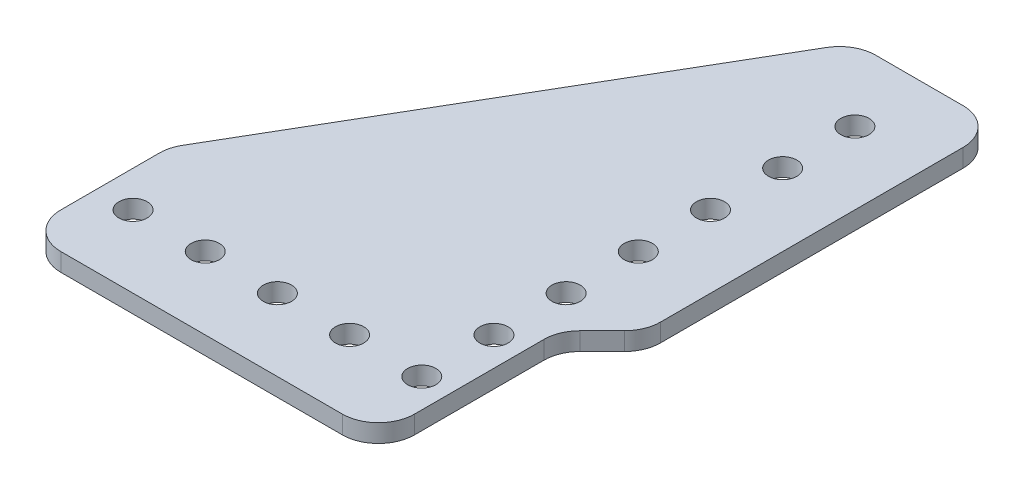
ISO-10303-21;
HEADER;
FILE_DESCRIPTION(('STEP AP214'),'2;1');
FILE_NAME('part.step','',(''),(''),'','','');
FILE_SCHEMA(('AUTOMOTIVE_DESIGN { 1 0 10303 214 1 1 1 1 }'));
ENDSEC;
DATA;
#1=APPLICATION_CONTEXT('core data for automotive mechanical design processes');
#2=APPLICATION_PROTOCOL_DEFINITION('international standard','automotive_design',2000,#1);
#3=PRODUCT_CONTEXT('',#1,'mechanical');
#4=PRODUCT('Part','Part','',(#3));
#5=PRODUCT_RELATED_PRODUCT_CATEGORY('part','',(#4));
#6=PRODUCT_DEFINITION_FORMATION('','',#4);
#7=PRODUCT_DEFINITION_CONTEXT('part definition',#1,'design');
#8=PRODUCT_DEFINITION('design','',#6,#7);
#9=PRODUCT_DEFINITION_SHAPE('','',#8);
#10=(LENGTH_UNIT() NAMED_UNIT(*) SI_UNIT(.MILLI.,.METRE.));
#11=(NAMED_UNIT(*) PLANE_ANGLE_UNIT() SI_UNIT($,.RADIAN.));
#12=(NAMED_UNIT(*) SI_UNIT($,.STERADIAN.) SOLID_ANGLE_UNIT());
#13=UNCERTAINTY_MEASURE_WITH_UNIT(LENGTH_MEASURE(1.E-05),#10,'distance_accuracy_value','');
#14=(GEOMETRIC_REPRESENTATION_CONTEXT(3) GLOBAL_UNCERTAINTY_ASSIGNED_CONTEXT((#13)) GLOBAL_UNIT_ASSIGNED_CONTEXT((#10,
#11,#12)) REPRESENTATION_CONTEXT('',''));
#15=CARTESIAN_POINT('',(0.,0.,0.));
#16=DIRECTION('',(0.,0.,1.));
#17=DIRECTION('',(1.,0.,0.));
#18=AXIS2_PLACEMENT_3D('',#15,#16,#17);
#19=CARTESIAN_POINT('',(-63.5,3.175,-12.7));
#20=DIRECTION('',(0.,-1.,0.));
#21=DIRECTION('',(0.,0.,-1.));
#22=AXIS2_PLACEMENT_3D('',#19,#20,#21);
#23=CYLINDRICAL_SURFACE('',#22,2.4892);
#24=CARTESIAN_POINT('',(-63.5,3.175,-12.7));
#25=DIRECTION('',(0.,1.,0.));
#26=DIRECTION('',(0.,0.,1.));
#27=AXIS2_PLACEMENT_3D('',#24,#25,#26);
#28=CIRCLE('',#27,2.4892);
#29=CARTESIAN_POINT('',(-63.5,3.175,-10.2108));
#30=VERTEX_POINT('',#29);
#31=EDGE_CURVE('E258',#30,#30,#28,.T.);
#32=ORIENTED_EDGE('',*,*,#31,.T.);
#33=EDGE_LOOP('',(#32));
#34=FACE_BOUND('',#33,.T.);
#35=CARTESIAN_POINT('',(-63.5,0.,-12.7));
#36=DIRECTION('',(0.,1.,0.));
#37=DIRECTION('',(0.,0.,1.));
#38=AXIS2_PLACEMENT_3D('',#35,#36,#37);
#39=CIRCLE('',#38,2.4892);
#40=CARTESIAN_POINT('',(-63.5,0.,-10.2108));
#41=VERTEX_POINT('',#40);
#42=EDGE_CURVE('E261',#41,#41,#39,.T.);
#43=ORIENTED_EDGE('',*,*,#42,.F.);
#44=EDGE_LOOP('',(#43));
#45=FACE_BOUND('',#44,.T.);
#46=ADVANCED_FACE('F35',(#34,#45),#23,.F.);
#47=CARTESIAN_POINT('',(-50.8,3.175,-12.7));
#48=DIRECTION('',(0.,-1.,0.));
#49=DIRECTION('',(0.,0.,-1.));
#50=AXIS2_PLACEMENT_3D('',#47,#48,#49);
#51=CYLINDRICAL_SURFACE('',#50,2.4892);
#52=CARTESIAN_POINT('',(-50.8,3.175,-12.7));
#53=DIRECTION('',(0.,1.,0.));
#54=DIRECTION('',(0.,0.,1.));
#55=AXIS2_PLACEMENT_3D('',#52,#53,#54);
#56=CIRCLE('',#55,2.4892);
#57=CARTESIAN_POINT('',(-50.8,3.175,-10.2108));
#58=VERTEX_POINT('',#57);
#59=EDGE_CURVE('E252',#58,#58,#56,.T.);
#60=ORIENTED_EDGE('',*,*,#59,.T.);
#61=EDGE_LOOP('',(#60));
#62=FACE_BOUND('',#61,.T.);
#63=CARTESIAN_POINT('',(-50.8,0.,-12.7));
#64=DIRECTION('',(0.,1.,0.));
#65=DIRECTION('',(0.,0.,1.));
#66=AXIS2_PLACEMENT_3D('',#63,#64,#65);
#67=CIRCLE('',#66,2.4892);
#68=CARTESIAN_POINT('',(-50.8,0.,-10.2108));
#69=VERTEX_POINT('',#68);
#70=EDGE_CURVE('E255',#69,#69,#67,.T.);
#71=ORIENTED_EDGE('',*,*,#70,.F.);
#72=EDGE_LOOP('',(#71));
#73=FACE_BOUND('',#72,.T.);
#74=ADVANCED_FACE('F370',(#62,#73),#51,.F.);
#75=CARTESIAN_POINT('',(-38.1,3.175,-12.7));
#76=DIRECTION('',(0.,-1.,0.));
#77=DIRECTION('',(0.,0.,-1.));
#78=AXIS2_PLACEMENT_3D('',#75,#76,#77);
#79=CYLINDRICAL_SURFACE('',#78,2.4892);
#80=CARTESIAN_POINT('',(-38.1,3.175,-12.7));
#81=DIRECTION('',(0.,1.,0.));
#82=DIRECTION('',(0.,0.,1.));
#83=AXIS2_PLACEMENT_3D('',#80,#81,#82);
#84=CIRCLE('',#83,2.4892);
#85=CARTESIAN_POINT('',(-38.1,3.175,-10.2108));
#86=VERTEX_POINT('',#85);
#87=EDGE_CURVE('E246',#86,#86,#84,.T.);
#88=ORIENTED_EDGE('',*,*,#87,.T.);
#89=EDGE_LOOP('',(#88));
#90=FACE_BOUND('',#89,.T.);
#91=CARTESIAN_POINT('',(-38.1,0.,-12.7));
#92=DIRECTION('',(0.,1.,0.));
#93=DIRECTION('',(0.,0.,1.));
#94=AXIS2_PLACEMENT_3D('',#91,#92,#93);
#95=CIRCLE('',#94,2.4892);
#96=CARTESIAN_POINT('',(-38.1,0.,-10.2108));
#97=VERTEX_POINT('',#96);
#98=EDGE_CURVE('E249',#97,#97,#95,.T.);
#99=ORIENTED_EDGE('',*,*,#98,.F.);
#100=EDGE_LOOP('',(#99));
#101=FACE_BOUND('',#100,.T.);
#102=ADVANCED_FACE('F376',(#90,#101),#79,.F.);
#103=CARTESIAN_POINT('',(-25.4,3.175,-12.7));
#104=DIRECTION('',(0.,-1.,0.));
#105=DIRECTION('',(0.,0.,-1.));
#106=AXIS2_PLACEMENT_3D('',#103,#104,#105);
#107=CYLINDRICAL_SURFACE('',#106,2.4892);
#108=CARTESIAN_POINT('',(-25.4,3.175,-12.7));
#109=DIRECTION('',(0.,1.,0.));
#110=DIRECTION('',(0.,0.,1.));
#111=AXIS2_PLACEMENT_3D('',#108,#109,#110);
#112=CIRCLE('',#111,2.4892);
#113=CARTESIAN_POINT('',(-25.4,3.175,-10.2108));
#114=VERTEX_POINT('',#113);
#115=EDGE_CURVE('E240',#114,#114,#112,.T.);
#116=ORIENTED_EDGE('',*,*,#115,.T.);
#117=EDGE_LOOP('',(#116));
#118=FACE_BOUND('',#117,.T.);
#119=CARTESIAN_POINT('',(-25.4,0.,-12.7));
#120=DIRECTION('',(0.,1.,0.));
#121=DIRECTION('',(0.,0.,1.));
#122=AXIS2_PLACEMENT_3D('',#119,#120,#121);
#123=CIRCLE('',#122,2.4892);
#124=CARTESIAN_POINT('',(-25.4,0.,-10.2108));
#125=VERTEX_POINT('',#124);
#126=EDGE_CURVE('E243',#125,#125,#123,.T.);
#127=ORIENTED_EDGE('',*,*,#126,.F.);
#128=EDGE_LOOP('',(#127));
#129=FACE_BOUND('',#128,.T.);
#130=ADVANCED_FACE('F558',(#118,#129),#107,.F.);
#131=CARTESIAN_POINT('',(-12.7,3.175,-88.9));
#132=DIRECTION('',(0.,-1.,0.));
#133=DIRECTION('',(0.,0.,-1.));
#134=AXIS2_PLACEMENT_3D('',#131,#132,#133);
#135=CYLINDRICAL_SURFACE('',#134,2.4892);
#136=CARTESIAN_POINT('',(-12.7,3.175,-88.9));
#137=DIRECTION('',(0.,1.,0.));
#138=DIRECTION('',(0.,0.,1.));
#139=AXIS2_PLACEMENT_3D('',#136,#137,#138);
#140=CIRCLE('',#139,2.4892);
#141=CARTESIAN_POINT('',(-12.7,3.175,-86.4108));
#142=VERTEX_POINT('',#141);
#143=EDGE_CURVE('E234',#142,#142,#140,.T.);
#144=ORIENTED_EDGE('',*,*,#143,.T.);
#145=EDGE_LOOP('',(#144));
#146=FACE_BOUND('',#145,.T.);
#147=CARTESIAN_POINT('',(-12.7,0.,-88.9));
#148=DIRECTION('',(0.,1.,0.));
#149=DIRECTION('',(0.,0.,1.));
#150=AXIS2_PLACEMENT_3D('',#147,#148,#149);
#151=CIRCLE('',#150,2.4892);
#152=CARTESIAN_POINT('',(-12.7,0.,-86.4108));
#153=VERTEX_POINT('',#152);
#154=EDGE_CURVE('E237',#153,#153,#151,.T.);
#155=ORIENTED_EDGE('',*,*,#154,.F.);
#156=EDGE_LOOP('',(#155));
#157=FACE_BOUND('',#156,.T.);
#158=ADVANCED_FACE('F548',(#146,#157),#135,.F.);
#159=CARTESIAN_POINT('',(-12.7,3.175,-76.2));
#160=DIRECTION('',(0.,-1.,0.));
#161=DIRECTION('',(0.,0.,-1.));
#162=AXIS2_PLACEMENT_3D('',#159,#160,#161);
#163=CYLINDRICAL_SURFACE('',#162,2.4892);
#164=CARTESIAN_POINT('',(-12.7,3.175,-76.2));
#165=DIRECTION('',(0.,1.,0.));
#166=DIRECTION('',(0.,0.,1.));
#167=AXIS2_PLACEMENT_3D('',#164,#165,#166);
#168=CIRCLE('',#167,2.4892);
#169=CARTESIAN_POINT('',(-12.7,3.175,-73.7108));
#170=VERTEX_POINT('',#169);
#171=EDGE_CURVE('E228',#170,#170,#168,.T.);
#172=ORIENTED_EDGE('',*,*,#171,.T.);
#173=EDGE_LOOP('',(#172));
#174=FACE_BOUND('',#173,.T.);
#175=CARTESIAN_POINT('',(-12.7,0.,-76.2));
#176=DIRECTION('',(0.,1.,0.));
#177=DIRECTION('',(0.,0.,1.));
#178=AXIS2_PLACEMENT_3D('',#175,#176,#177);
#179=CIRCLE('',#178,2.4892);
#180=CARTESIAN_POINT('',(-12.7,0.,-73.7108));
#181=VERTEX_POINT('',#180);
#182=EDGE_CURVE('E231',#181,#181,#179,.T.);
#183=ORIENTED_EDGE('',*,*,#182,.F.);
#184=EDGE_LOOP('',(#183));
#185=FACE_BOUND('',#184,.T.);
#186=ADVANCED_FACE('F538',(#174,#185),#163,.F.);
#187=CARTESIAN_POINT('',(-12.7,3.175,-63.5));
#188=DIRECTION('',(0.,-1.,0.));
#189=DIRECTION('',(0.,0.,-1.));
#190=AXIS2_PLACEMENT_3D('',#187,#188,#189);
#191=CYLINDRICAL_SURFACE('',#190,2.4892);
#192=CARTESIAN_POINT('',(-12.7,3.175,-63.5));
#193=DIRECTION('',(0.,1.,0.));
#194=DIRECTION('',(0.,0.,1.));
#195=AXIS2_PLACEMENT_3D('',#192,#193,#194);
#196=CIRCLE('',#195,2.4892);
#197=CARTESIAN_POINT('',(-12.7,3.175,-61.0108));
#198=VERTEX_POINT('',#197);
#199=EDGE_CURVE('E222',#198,#198,#196,.T.);
#200=ORIENTED_EDGE('',*,*,#199,.T.);
#201=EDGE_LOOP('',(#200));
#202=FACE_BOUND('',#201,.T.);
#203=CARTESIAN_POINT('',(-12.7,0.,-63.5));
#204=DIRECTION('',(0.,1.,0.));
#205=DIRECTION('',(0.,0.,1.));
#206=AXIS2_PLACEMENT_3D('',#203,#204,#205);
#207=CIRCLE('',#206,2.4892);
#208=CARTESIAN_POINT('',(-12.7,0.,-61.0108));
#209=VERTEX_POINT('',#208);
#210=EDGE_CURVE('E225',#209,#209,#207,.T.);
#211=ORIENTED_EDGE('',*,*,#210,.F.);
#212=EDGE_LOOP('',(#211));
#213=FACE_BOUND('',#212,.T.);
#214=ADVANCED_FACE('F528',(#202,#213),#191,.F.);
#215=CARTESIAN_POINT('',(-12.7,3.175,-50.8));
#216=DIRECTION('',(0.,-1.,0.));
#217=DIRECTION('',(0.,0.,-1.));
#218=AXIS2_PLACEMENT_3D('',#215,#216,#217);
#219=CYLINDRICAL_SURFACE('',#218,2.4892);
#220=CARTESIAN_POINT('',(-12.7,3.175,-50.8));
#221=DIRECTION('',(0.,1.,0.));
#222=DIRECTION('',(0.,0.,1.));
#223=AXIS2_PLACEMENT_3D('',#220,#221,#222);
#224=CIRCLE('',#223,2.4892);
#225=CARTESIAN_POINT('',(-12.7,3.175,-48.3108));
#226=VERTEX_POINT('',#225);
#227=EDGE_CURVE('E216',#226,#226,#224,.T.);
#228=ORIENTED_EDGE('',*,*,#227,.T.);
#229=EDGE_LOOP('',(#228));
#230=FACE_BOUND('',#229,.T.);
#231=CARTESIAN_POINT('',(-12.7,0.,-50.8));
#232=DIRECTION('',(0.,1.,0.));
#233=DIRECTION('',(0.,0.,1.));
#234=AXIS2_PLACEMENT_3D('',#231,#232,#233);
#235=CIRCLE('',#234,2.4892);
#236=CARTESIAN_POINT('',(-12.7,0.,-48.3108));
#237=VERTEX_POINT('',#236);
#238=EDGE_CURVE('E219',#237,#237,#235,.T.);
#239=ORIENTED_EDGE('',*,*,#238,.F.);
#240=EDGE_LOOP('',(#239));
#241=FACE_BOUND('',#240,.T.);
#242=ADVANCED_FACE('F518',(#230,#241),#219,.F.);
#243=CARTESIAN_POINT('',(-12.7,3.175,-38.1));
#244=DIRECTION('',(0.,-1.,0.));
#245=DIRECTION('',(0.,0.,-1.));
#246=AXIS2_PLACEMENT_3D('',#243,#244,#245);
#247=CYLINDRICAL_SURFACE('',#246,2.4892);
#248=CARTESIAN_POINT('',(-12.7,3.175,-38.1));
#249=DIRECTION('',(0.,1.,0.));
#250=DIRECTION('',(0.,0.,1.));
#251=AXIS2_PLACEMENT_3D('',#248,#249,#250);
#252=CIRCLE('',#251,2.4892);
#253=CARTESIAN_POINT('',(-12.7,3.175,-35.6108));
#254=VERTEX_POINT('',#253);
#255=EDGE_CURVE('E210',#254,#254,#252,.T.);
#256=ORIENTED_EDGE('',*,*,#255,.T.);
#257=EDGE_LOOP('',(#256));
#258=FACE_BOUND('',#257,.T.);
#259=CARTESIAN_POINT('',(-12.7,0.,-38.1));
#260=DIRECTION('',(0.,1.,0.));
#261=DIRECTION('',(0.,0.,1.));
#262=AXIS2_PLACEMENT_3D('',#259,#260,#261);
#263=CIRCLE('',#262,2.4892);
#264=CARTESIAN_POINT('',(-12.7,0.,-35.6108));
#265=VERTEX_POINT('',#264);
#266=EDGE_CURVE('E213',#265,#265,#263,.T.);
#267=ORIENTED_EDGE('',*,*,#266,.F.);
#268=EDGE_LOOP('',(#267));
#269=FACE_BOUND('',#268,.T.);
#270=ADVANCED_FACE('F508',(#258,#269),#247,.F.);
#271=CARTESIAN_POINT('',(-12.7,3.175,-25.4));
#272=DIRECTION('',(0.,-1.,0.));
#273=DIRECTION('',(0.,0.,-1.));
#274=AXIS2_PLACEMENT_3D('',#271,#272,#273);
#275=CYLINDRICAL_SURFACE('',#274,2.4892);
#276=CARTESIAN_POINT('',(-12.7,3.175,-25.4));
#277=DIRECTION('',(0.,1.,0.));
#278=DIRECTION('',(0.,0.,1.));
#279=AXIS2_PLACEMENT_3D('',#276,#277,#278);
#280=CIRCLE('',#279,2.4892);
#281=CARTESIAN_POINT('',(-12.7,3.175,-22.9108));
#282=VERTEX_POINT('',#281);
#283=EDGE_CURVE('E192',#282,#282,#280,.T.);
#284=ORIENTED_EDGE('',*,*,#283,.T.);
#285=EDGE_LOOP('',(#284));
#286=FACE_BOUND('',#285,.T.);
#287=CARTESIAN_POINT('',(-12.7,0.,-25.4));
#288=DIRECTION('',(0.,1.,0.));
#289=DIRECTION('',(0.,0.,1.));
#290=AXIS2_PLACEMENT_3D('',#287,#288,#289);
#291=CIRCLE('',#290,2.4892);
#292=CARTESIAN_POINT('',(-12.7,0.,-22.9108));
#293=VERTEX_POINT('',#292);
#294=EDGE_CURVE('E207',#293,#293,#291,.T.);
#295=ORIENTED_EDGE('',*,*,#294,.F.);
#296=EDGE_LOOP('',(#295));
#297=FACE_BOUND('',#296,.T.);
#298=ADVANCED_FACE('F499',(#286,#297),#275,.F.);
#299=CARTESIAN_POINT('',(0.,3.175,0.));
#300=DIRECTION('',(0.,-1.,0.));
#301=DIRECTION('',(0.,0.,-1.));
#302=AXIS2_PLACEMENT_3D('',#299,#300,#301);
#303=PLANE('',#302);
#304=ORIENTED_EDGE('',*,*,#31,.F.);
#305=EDGE_LOOP('',(#304));
#306=FACE_BOUND('',#305,.T.);
#307=ORIENTED_EDGE('',*,*,#59,.F.);
#308=EDGE_LOOP('',(#307));
#309=FACE_BOUND('',#308,.T.);
#310=ORIENTED_EDGE('',*,*,#87,.F.);
#311=EDGE_LOOP('',(#310));
#312=FACE_BOUND('',#311,.T.);
#313=ORIENTED_EDGE('',*,*,#115,.F.);
#314=EDGE_LOOP('',(#313));
#315=FACE_BOUND('',#314,.T.);
#316=ORIENTED_EDGE('',*,*,#143,.F.);
#317=EDGE_LOOP('',(#316));
#318=FACE_BOUND('',#317,.T.);
#319=ORIENTED_EDGE('',*,*,#171,.F.);
#320=EDGE_LOOP('',(#319));
#321=FACE_BOUND('',#320,.T.);
#322=ORIENTED_EDGE('',*,*,#199,.F.);
#323=EDGE_LOOP('',(#322));
#324=FACE_BOUND('',#323,.T.);
#325=ORIENTED_EDGE('',*,*,#227,.F.);
#326=EDGE_LOOP('',(#325));
#327=FACE_BOUND('',#326,.T.);
#328=ORIENTED_EDGE('',*,*,#255,.F.);
#329=EDGE_LOOP('',(#328));
#330=FACE_BOUND('',#329,.T.);
#331=ORIENTED_EDGE('',*,*,#283,.F.);
#332=EDGE_LOOP('',(#331));
#333=FACE_BOUND('',#332,.T.);
#334=DIRECTION('',(-0.707106781186541,0.,0.707106781186554));
#335=VECTOR('',#334,1.);
#336=CARTESIAN_POINT('',(-7.62,3.175,-31.75));
#337=LINE('',#336,#335);
#338=CARTESIAN_POINT('',(-1.85987193946538,3.175,-37.5101280605347));
#339=VERTEX_POINT('',#338);
#340=CARTESIAN_POINT('',(-5.76012806053462,3.175,-33.6098719394654));
#341=VERTEX_POINT('',#340);
#342=EDGE_CURVE('E163',#339,#341,#337,.T.);
#343=ORIENTED_EDGE('',*,*,#342,.F.);
#344=CARTESIAN_POINT('',(-6.35,3.175,-42.0002561210692));
#345=DIRECTION('',(0.,-1.,0.));
#346=DIRECTION('',(0.,0.,-1.));
#347=AXIS2_PLACEMENT_3D('',#344,#345,#346);
#348=CIRCLE('',#347,6.35);
#349=CARTESIAN_POINT('',(0.,3.175,-42.0002561210692));
#350=VERTEX_POINT('',#349);
#351=EDGE_CURVE('E277',#339,#350,#348,.F.);
#352=ORIENTED_EDGE('',*,*,#351,.T.);
#353=DIRECTION('',(0.,0.,-1.));
#354=VECTOR('',#353,1.);
#355=CARTESIAN_POINT('',(0.,3.175,0.));
#356=LINE('',#355,#354);
#357=CARTESIAN_POINT('',(0.,3.175,-95.25));
#358=VERTEX_POINT('',#357);
#359=EDGE_CURVE('E179',#350,#358,#356,.T.);
#360=ORIENTED_EDGE('',*,*,#359,.T.);
#361=CARTESIAN_POINT('',(-6.35,3.175,-95.25));
#362=DIRECTION('',(0.,-1.,0.));
#363=DIRECTION('',(0.,0.,-1.));
#364=AXIS2_PLACEMENT_3D('',#361,#362,#363);
#365=CIRCLE('',#364,6.35);
#366=CARTESIAN_POINT('',(-6.35,3.175,-101.6));
#367=VERTEX_POINT('',#366);
#368=EDGE_CURVE('E275',#358,#367,#365,.F.);
#369=ORIENTED_EDGE('',*,*,#368,.T.);
#370=DIRECTION('',(-1.,0.,0.));
#371=VECTOR('',#370,1.);
#372=CARTESIAN_POINT('',(-25.4,3.175,-101.6));
#373=LINE('',#372,#371);
#374=CARTESIAN_POINT('',(-21.7527483889161,3.175,-101.6));
#375=VERTEX_POINT('',#374);
#376=EDGE_CURVE('E183',#367,#375,#373,.T.);
#377=ORIENTED_EDGE('',*,*,#376,.T.);
#378=CARTESIAN_POINT('',(-21.7527483889161,3.175,-95.25));
#379=DIRECTION('',(0.,-1.,0.));
#380=DIRECTION('',(0.,0.,-1.));
#381=AXIS2_PLACEMENT_3D('',#378,#379,#380);
#382=CIRCLE('',#381,6.35);
#383=CARTESIAN_POINT('',(-27.2377444096212,3.175,-98.4495810120779));
#384=VERTEX_POINT('',#383);
#385=EDGE_CURVE('E273',#375,#384,#382,.F.);
#386=ORIENTED_EDGE('',*,*,#385,.T.);
#387=DIRECTION('',(-0.503871025524086,0.,0.863778900898433));
#388=VECTOR('',#387,1.);
#389=CARTESIAN_POINT('',(-69.85,3.175,-25.4));
#390=LINE('',#389,#388);
#391=CARTESIAN_POINT('',(-68.9849960207051,3.175,-26.8828639645056));
#392=VERTEX_POINT('',#391);
#393=EDGE_CURVE('E186',#384,#392,#390,.T.);
#394=ORIENTED_EDGE('',*,*,#393,.T.);
#395=CARTESIAN_POINT('',(-63.5,3.175,-23.6832829524276));
#396=DIRECTION('',(0.,-1.,0.));
#397=DIRECTION('',(0.,0.,-1.));
#398=AXIS2_PLACEMENT_3D('',#395,#396,#397);
#399=CIRCLE('',#398,6.35);
#400=CARTESIAN_POINT('',(-69.85,3.175,-23.6832829524276));
#401=VERTEX_POINT('',#400);
#402=EDGE_CURVE('E271',#392,#401,#399,.F.);
#403=ORIENTED_EDGE('',*,*,#402,.T.);
#404=DIRECTION('',(0.,0.,1.));
#405=VECTOR('',#404,1.);
#406=CARTESIAN_POINT('',(-69.85,3.175,0.));
#407=LINE('',#406,#405);
#408=CARTESIAN_POINT('',(-69.85,3.175,-6.34999999999999));
#409=VERTEX_POINT('',#408);
#410=EDGE_CURVE('E189',#401,#409,#407,.T.);
#411=ORIENTED_EDGE('',*,*,#410,.T.);
#412=CARTESIAN_POINT('',(-63.5,3.175,-6.34999999999999));
#413=DIRECTION('',(0.,-1.,0.));
#414=DIRECTION('',(0.,0.,-1.));
#415=AXIS2_PLACEMENT_3D('',#412,#413,#414);
#416=CIRCLE('',#415,6.35);
#417=CARTESIAN_POINT('',(-63.5,3.175,0.));
#418=VERTEX_POINT('',#417);
#419=EDGE_CURVE('E269',#409,#418,#416,.F.);
#420=ORIENTED_EDGE('',*,*,#419,.T.);
#421=DIRECTION('',(1.,0.,0.));
#422=VECTOR('',#421,1.);
#423=CARTESIAN_POINT('',(0.,3.175,0.));
#424=LINE('',#423,#422);
#425=CARTESIAN_POINT('',(-13.97,3.175,0.));
#426=VERTEX_POINT('',#425);
#427=EDGE_CURVE('E177',#418,#426,#424,.T.);
#428=ORIENTED_EDGE('',*,*,#427,.T.);
#429=CARTESIAN_POINT('',(-13.97,3.175,-6.35));
#430=DIRECTION('',(0.,-1.,0.));
#431=DIRECTION('',(0.,0.,-1.));
#432=AXIS2_PLACEMENT_3D('',#429,#430,#431);
#433=CIRCLE('',#432,6.35);
#434=CARTESIAN_POINT('',(-7.62,3.175,-6.35));
#435=VERTEX_POINT('',#434);
#436=EDGE_CURVE('E161',#426,#435,#433,.F.);
#437=ORIENTED_EDGE('',*,*,#436,.T.);
#438=DIRECTION('',(0.,0.,1.));
#439=VECTOR('',#438,1.);
#440=CARTESIAN_POINT('',(-7.62,3.175,0.));
#441=LINE('',#440,#439);
#442=CARTESIAN_POINT('',(-7.62,3.175,-29.1197438789309));
#443=VERTEX_POINT('',#442);
#444=EDGE_CURVE('E151',#443,#435,#441,.T.);
#445=ORIENTED_EDGE('',*,*,#444,.F.);
#446=CARTESIAN_POINT('',(-1.27,3.175,-29.1197438789309));
#447=DIRECTION('',(0.,-1.,0.));
#448=DIRECTION('',(0.,0.,-1.));
#449=AXIS2_PLACEMENT_3D('',#446,#447,#448);
#450=CIRCLE('',#449,6.35);
#451=EDGE_CURVE('E43',#443,#341,#450,.T.);
#452=ORIENTED_EDGE('',*,*,#451,.T.);
#453=EDGE_LOOP('',(#343,#352,#360,#369,#377,#386,#394,#403,#411,#420,#428,#437,#445,#452));
#454=FACE_BOUND('',#453,.T.);
#455=CARTESIAN_POINT('',(-12.7,3.175,-12.7));
#456=DIRECTION('',(0.,1.,0.));
#457=DIRECTION('',(0.,0.,1.));
#458=AXIS2_PLACEMENT_3D('',#455,#456,#457);
#459=CIRCLE('',#458,2.4892);
#460=CARTESIAN_POINT('',(-12.7,3.175,-10.2108));
#461=VERTEX_POINT('',#460);
#462=EDGE_CURVE('E170',#461,#461,#459,.T.);
#463=ORIENTED_EDGE('',*,*,#462,.F.);
#464=EDGE_LOOP('',(#463));
#465=FACE_BOUND('',#464,.T.);
#466=ADVANCED_FACE('F158',(#306,#309,#312,#315,#318,#321,#324,#327,#330,#333,#454,#465),#303,.F.);
#467=CARTESIAN_POINT('',(0.,0.,0.));
#468=DIRECTION('',(0.,-1.,0.));
#469=DIRECTION('',(0.,0.,-1.));
#470=AXIS2_PLACEMENT_3D('',#467,#468,#469);
#471=PLANE('',#470);
#472=DIRECTION('',(0.,0.,-1.));
#473=VECTOR('',#472,1.);
#474=CARTESIAN_POINT('',(0.,0.,0.));
#475=LINE('',#474,#473);
#476=CARTESIAN_POINT('',(0.,0.,-42.0002561210692));
#477=VERTEX_POINT('',#476);
#478=CARTESIAN_POINT('',(0.,0.,-95.25));
#479=VERTEX_POINT('',#478);
#480=EDGE_CURVE('E195',#477,#479,#475,.T.);
#481=ORIENTED_EDGE('',*,*,#480,.F.);
#482=CARTESIAN_POINT('',(-6.35,0.,-42.0002561210692));
#483=DIRECTION('',(0.,-1.,0.));
#484=DIRECTION('',(0.,0.,-1.));
#485=AXIS2_PLACEMENT_3D('',#482,#483,#484);
#486=CIRCLE('',#485,6.35);
#487=CARTESIAN_POINT('',(-1.85987193946538,0.,-37.5101280605347));
#488=VERTEX_POINT('',#487);
#489=EDGE_CURVE('E291',#477,#488,#486,.T.);
#490=ORIENTED_EDGE('',*,*,#489,.T.);
#491=DIRECTION('',(-0.707106781186541,0.,0.707106781186554));
#492=VECTOR('',#491,1.);
#493=CARTESIAN_POINT('',(-7.62,0.,-31.75));
#494=LINE('',#493,#492);
#495=CARTESIAN_POINT('',(-5.76012806053462,0.,-33.6098719394654));
#496=VERTEX_POINT('',#495);
#497=EDGE_CURVE('E162',#488,#496,#494,.T.);
#498=ORIENTED_EDGE('',*,*,#497,.T.);
#499=CARTESIAN_POINT('',(-1.27,0.,-29.1197438789309));
#500=DIRECTION('',(0.,-1.,0.));
#501=DIRECTION('',(0.,0.,-1.));
#502=AXIS2_PLACEMENT_3D('',#499,#500,#501);
#503=CIRCLE('',#502,6.35);
#504=CARTESIAN_POINT('',(-7.62,0.,-29.1197438789309));
#505=VERTEX_POINT('',#504);
#506=EDGE_CURVE('E11',#496,#505,#503,.F.);
#507=ORIENTED_EDGE('',*,*,#506,.T.);
#508=DIRECTION('',(0.,0.,1.));
#509=VECTOR('',#508,1.);
#510=CARTESIAN_POINT('',(-7.62,0.,0.));
#511=LINE('',#510,#509);
#512=CARTESIAN_POINT('',(-7.62,0.,-6.35));
#513=VERTEX_POINT('',#512);
#514=EDGE_CURVE('E154',#505,#513,#511,.T.);
#515=ORIENTED_EDGE('',*,*,#514,.T.);
#516=CARTESIAN_POINT('',(-13.97,0.,-6.35));
#517=DIRECTION('',(0.,-1.,0.));
#518=DIRECTION('',(0.,0.,-1.));
#519=AXIS2_PLACEMENT_3D('',#516,#517,#518);
#520=CIRCLE('',#519,6.35);
#521=CARTESIAN_POINT('',(-13.97,0.,0.));
#522=VERTEX_POINT('',#521);
#523=EDGE_CURVE('E283',#513,#522,#520,.T.);
#524=ORIENTED_EDGE('',*,*,#523,.T.);
#525=DIRECTION('',(1.,0.,0.));
#526=VECTOR('',#525,1.);
#527=CARTESIAN_POINT('',(0.,0.,0.));
#528=LINE('',#527,#526);
#529=CARTESIAN_POINT('',(-63.5,0.,0.));
#530=VERTEX_POINT('',#529);
#531=EDGE_CURVE('E173',#530,#522,#528,.T.);
#532=ORIENTED_EDGE('',*,*,#531,.F.);
#533=CARTESIAN_POINT('',(-63.5,0.,-6.34999999999999));
#534=DIRECTION('',(0.,-1.,0.));
#535=DIRECTION('',(0.,0.,-1.));
#536=AXIS2_PLACEMENT_3D('',#533,#534,#535);
#537=CIRCLE('',#536,6.35);
#538=CARTESIAN_POINT('',(-69.85,0.,-6.34999999999999));
#539=VERTEX_POINT('',#538);
#540=EDGE_CURVE('E285',#530,#539,#537,.T.);
#541=ORIENTED_EDGE('',*,*,#540,.T.);
#542=DIRECTION('',(0.,0.,1.));
#543=VECTOR('',#542,1.);
#544=CARTESIAN_POINT('',(-69.85,0.,0.));
#545=LINE('',#544,#543);
#546=CARTESIAN_POINT('',(-69.85,0.,-23.6832829524276));
#547=VERTEX_POINT('',#546);
#548=EDGE_CURVE('E180',#547,#539,#545,.T.);
#549=ORIENTED_EDGE('',*,*,#548,.F.);
#550=CARTESIAN_POINT('',(-63.5,0.,-23.6832829524276));
#551=DIRECTION('',(0.,-1.,0.));
#552=DIRECTION('',(0.,0.,-1.));
#553=AXIS2_PLACEMENT_3D('',#550,#551,#552);
#554=CIRCLE('',#553,6.35);
#555=CARTESIAN_POINT('',(-68.9849960207051,0.,-26.8828639645056));
#556=VERTEX_POINT('',#555);
#557=EDGE_CURVE('E287',#547,#556,#554,.T.);
#558=ORIENTED_EDGE('',*,*,#557,.T.);
#559=DIRECTION('',(-0.503871025524086,0.,0.863778900898433));
#560=VECTOR('',#559,1.);
#561=CARTESIAN_POINT('',(-69.85,0.,-25.4));
#562=LINE('',#561,#560);
#563=CARTESIAN_POINT('',(-27.2377444096212,0.,-98.4495810120779));
#564=VERTEX_POINT('',#563);
#565=EDGE_CURVE('E200',#564,#556,#562,.T.);
#566=ORIENTED_EDGE('',*,*,#565,.F.);
#567=CARTESIAN_POINT('',(-21.7527483889161,0.,-95.25));
#568=DIRECTION('',(0.,-1.,0.));
#569=DIRECTION('',(0.,0.,-1.));
#570=AXIS2_PLACEMENT_3D('',#567,#568,#569);
#571=CIRCLE('',#570,6.35);
#572=CARTESIAN_POINT('',(-21.7527483889161,0.,-101.6));
#573=VERTEX_POINT('',#572);
#574=EDGE_CURVE('E50',#564,#573,#571,.T.);
#575=ORIENTED_EDGE('',*,*,#574,.T.);
#576=DIRECTION('',(-1.,0.,0.));
#577=VECTOR('',#576,1.);
#578=CARTESIAN_POINT('',(-25.4,0.,-101.6));
#579=LINE('',#578,#577);
#580=CARTESIAN_POINT('',(-6.35,0.,-101.6));
#581=VERTEX_POINT('',#580);
#582=EDGE_CURVE('E198',#581,#573,#579,.T.);
#583=ORIENTED_EDGE('',*,*,#582,.F.);
#584=CARTESIAN_POINT('',(-6.35,0.,-95.25));
#585=DIRECTION('',(0.,-1.,0.));
#586=DIRECTION('',(0.,0.,-1.));
#587=AXIS2_PLACEMENT_3D('',#584,#585,#586);
#588=CIRCLE('',#587,6.35);
#589=EDGE_CURVE('E58',#581,#479,#588,.T.);
#590=ORIENTED_EDGE('',*,*,#589,.T.);
#591=EDGE_LOOP('',(#481,#490,#498,#507,#515,#524,#532,#541,#549,#558,#566,#575,#583,#590));
#592=FACE_BOUND('',#591,.T.);
#593=ORIENTED_EDGE('',*,*,#42,.T.);
#594=EDGE_LOOP('',(#593));
#595=FACE_BOUND('',#594,.T.);
#596=ORIENTED_EDGE('',*,*,#70,.T.);
#597=EDGE_LOOP('',(#596));
#598=FACE_BOUND('',#597,.T.);
#599=ORIENTED_EDGE('',*,*,#98,.T.);
#600=EDGE_LOOP('',(#599));
#601=FACE_BOUND('',#600,.T.);
#602=ORIENTED_EDGE('',*,*,#126,.T.);
#603=EDGE_LOOP('',(#602));
#604=FACE_BOUND('',#603,.T.);
#605=ORIENTED_EDGE('',*,*,#154,.T.);
#606=EDGE_LOOP('',(#605));
#607=FACE_BOUND('',#606,.T.);
#608=ORIENTED_EDGE('',*,*,#182,.T.);
#609=EDGE_LOOP('',(#608));
#610=FACE_BOUND('',#609,.T.);
#611=ORIENTED_EDGE('',*,*,#210,.T.);
#612=EDGE_LOOP('',(#611));
#613=FACE_BOUND('',#612,.T.);
#614=ORIENTED_EDGE('',*,*,#238,.T.);
#615=EDGE_LOOP('',(#614));
#616=FACE_BOUND('',#615,.T.);
#617=ORIENTED_EDGE('',*,*,#266,.T.);
#618=EDGE_LOOP('',(#617));
#619=FACE_BOUND('',#618,.T.);
#620=ORIENTED_EDGE('',*,*,#294,.T.);
#621=EDGE_LOOP('',(#620));
#622=FACE_BOUND('',#621,.T.);
#623=CARTESIAN_POINT('',(-12.7,0.,-12.7));
#624=DIRECTION('',(0.,1.,0.));
#625=DIRECTION('',(0.,0.,1.));
#626=AXIS2_PLACEMENT_3D('',#623,#624,#625);
#627=CIRCLE('',#626,2.4892);
#628=CARTESIAN_POINT('',(-12.7,0.,-10.2108));
#629=VERTEX_POINT('',#628);
#630=EDGE_CURVE('E174',#629,#629,#627,.T.);
#631=ORIENTED_EDGE('',*,*,#630,.T.);
#632=EDGE_LOOP('',(#631));
#633=FACE_BOUND('',#632,.T.);
#634=ADVANCED_FACE('F320',(#592,#595,#598,#601,#604,#607,#610,#613,#616,#619,#622,#633),#471,.T.);
#635=CARTESIAN_POINT('',(0.,3.175,0.));
#636=DIRECTION('',(0.,0.,-1.));
#637=DIRECTION('',(-1.,0.,0.));
#638=AXIS2_PLACEMENT_3D('',#635,#636,#637);
#639=PLANE('',#638);
#640=ORIENTED_EDGE('',*,*,#427,.F.);
#641=DIRECTION('',(0.,-1.,0.));
#642=VECTOR('',#641,1.);
#643=CARTESIAN_POINT('',(-63.5,3.175,0.));
#644=LINE('',#643,#642);
#645=EDGE_CURVE('E146',#418,#530,#644,.T.);
#646=ORIENTED_EDGE('',*,*,#645,.T.);
#647=ORIENTED_EDGE('',*,*,#531,.T.);
#648=DIRECTION('',(0.,1.,0.));
#649=VECTOR('',#648,1.);
#650=CARTESIAN_POINT('',(-13.97,3.175,0.));
#651=LINE('',#650,#649);
#652=EDGE_CURVE('E307',#522,#426,#651,.T.);
#653=ORIENTED_EDGE('',*,*,#652,.T.);
#654=EDGE_LOOP('',(#640,#646,#647,#653));
#655=FACE_BOUND('',#654,.T.);
#656=ADVANCED_FACE('F315',(#655),#639,.F.);
#657=CARTESIAN_POINT('',(0.,3.175,0.));
#658=DIRECTION('',(-1.,0.,0.));
#659=DIRECTION('',(0.,0.,1.));
#660=AXIS2_PLACEMENT_3D('',#657,#658,#659);
#661=PLANE('',#660);
#662=ORIENTED_EDGE('',*,*,#359,.F.);
#663=DIRECTION('',(0.,1.,0.));
#664=VECTOR('',#663,1.);
#665=CARTESIAN_POINT('',(0.,3.175,-42.0002561210692));
#666=LINE('',#665,#664);
#667=EDGE_CURVE('E281',#350,#477,#666,.F.);
#668=ORIENTED_EDGE('',*,*,#667,.T.);
#669=ORIENTED_EDGE('',*,*,#480,.T.);
#670=DIRECTION('',(0.,-1.,0.));
#671=VECTOR('',#670,1.);
#672=CARTESIAN_POINT('',(0.,3.175,-95.25));
#673=LINE('',#672,#671);
#674=EDGE_CURVE('E279',#479,#358,#673,.F.);
#675=ORIENTED_EDGE('',*,*,#674,.T.);
#676=EDGE_LOOP('',(#662,#668,#669,#675));
#677=FACE_BOUND('',#676,.T.);
#678=ADVANCED_FACE('F351',(#677),#661,.F.);
#679=CARTESIAN_POINT('',(-25.4,3.175,-101.6));
#680=DIRECTION('',(0.,0.,1.));
#681=DIRECTION('',(1.,0.,0.));
#682=AXIS2_PLACEMENT_3D('',#679,#680,#681);
#683=PLANE('',#682);
#684=ORIENTED_EDGE('',*,*,#376,.F.);
#685=DIRECTION('',(0.,-1.,0.));
#686=VECTOR('',#685,1.);
#687=CARTESIAN_POINT('',(-6.35,3.175,-101.6));
#688=LINE('',#687,#686);
#689=EDGE_CURVE('E295',#367,#581,#688,.T.);
#690=ORIENTED_EDGE('',*,*,#689,.T.);
#691=ORIENTED_EDGE('',*,*,#582,.T.);
#692=DIRECTION('',(0.,-1.,0.));
#693=VECTOR('',#692,1.);
#694=CARTESIAN_POINT('',(-21.7527483889161,3.175,-101.6));
#695=LINE('',#694,#693);
#696=EDGE_CURVE('E293',#573,#375,#695,.F.);
#697=ORIENTED_EDGE('',*,*,#696,.T.);
#698=EDGE_LOOP('',(#684,#690,#691,#697));
#699=FACE_BOUND('',#698,.T.);
#700=ADVANCED_FACE('F345',(#699),#683,.F.);
#701=CARTESIAN_POINT('',(-69.85,3.175,-25.4));
#702=DIRECTION('',(0.863778900898433,0.,0.503871025524086));
#703=DIRECTION('',(0.503871025524086,0.,-0.863778900898434));
#704=AXIS2_PLACEMENT_3D('',#701,#702,#703);
#705=PLANE('',#704);
#706=ORIENTED_EDGE('',*,*,#393,.F.);
#707=DIRECTION('',(0.,-1.,0.));
#708=VECTOR('',#707,1.);
#709=CARTESIAN_POINT('',(-27.2377444096212,3.175,-98.4495810120779));
#710=LINE('',#709,#708);
#711=EDGE_CURVE('E299',#384,#564,#710,.T.);
#712=ORIENTED_EDGE('',*,*,#711,.T.);
#713=ORIENTED_EDGE('',*,*,#565,.T.);
#714=DIRECTION('',(0.,-1.,0.));
#715=VECTOR('',#714,1.);
#716=CARTESIAN_POINT('',(-68.9849960207051,3.175,-26.8828639645056));
#717=LINE('',#716,#715);
#718=EDGE_CURVE('E297',#556,#392,#717,.F.);
#719=ORIENTED_EDGE('',*,*,#718,.T.);
#720=EDGE_LOOP('',(#706,#712,#713,#719));
#721=FACE_BOUND('',#720,.T.);
#722=ADVANCED_FACE('F335',(#721),#705,.F.);
#723=CARTESIAN_POINT('',(-69.85,3.175,0.));
#724=DIRECTION('',(1.,0.,0.));
#725=DIRECTION('',(0.,0.,-1.));
#726=AXIS2_PLACEMENT_3D('',#723,#724,#725);
#727=PLANE('',#726);
#728=ORIENTED_EDGE('',*,*,#410,.F.);
#729=DIRECTION('',(0.,-1.,0.));
#730=VECTOR('',#729,1.);
#731=CARTESIAN_POINT('',(-69.85,3.175,-23.6832829524276));
#732=LINE('',#731,#730);
#733=EDGE_CURVE('E304',#401,#547,#732,.T.);
#734=ORIENTED_EDGE('',*,*,#733,.T.);
#735=ORIENTED_EDGE('',*,*,#548,.T.);
#736=DIRECTION('',(0.,-1.,0.));
#737=VECTOR('',#736,1.);
#738=CARTESIAN_POINT('',(-69.85,3.175,-6.34999999999999));
#739=LINE('',#738,#737);
#740=EDGE_CURVE('E302',#539,#409,#739,.F.);
#741=ORIENTED_EDGE('',*,*,#740,.T.);
#742=EDGE_LOOP('',(#728,#734,#735,#741));
#743=FACE_BOUND('',#742,.T.);
#744=ADVANCED_FACE('F329',(#743),#727,.F.);
#745=CARTESIAN_POINT('',(-12.7,3.175,-12.7));
#746=DIRECTION('',(0.,-1.,0.));
#747=DIRECTION('',(0.,0.,-1.));
#748=AXIS2_PLACEMENT_3D('',#745,#746,#747);
#749=CYLINDRICAL_SURFACE('',#748,2.4892);
#750=ORIENTED_EDGE('',*,*,#462,.T.);
#751=EDGE_LOOP('',(#750));
#752=FACE_BOUND('',#751,.T.);
#753=ORIENTED_EDGE('',*,*,#630,.F.);
#754=EDGE_LOOP('',(#753));
#755=FACE_BOUND('',#754,.T.);
#756=ADVANCED_FACE('F366',(#752,#755),#749,.F.);
#757=CARTESIAN_POINT('',(-7.62,0.,0.));
#758=DIRECTION('',(-1.,0.,0.));
#759=DIRECTION('',(0.,0.,1.));
#760=AXIS2_PLACEMENT_3D('',#757,#758,#759);
#761=PLANE('',#760);
#762=ORIENTED_EDGE('',*,*,#514,.F.);
#763=DIRECTION('',(0.,1.,0.));
#764=VECTOR('',#763,1.);
#765=CARTESIAN_POINT('',(-7.62,3.175,-29.1197438789309));
#766=LINE('',#765,#764);
#767=EDGE_CURVE('E140',#505,#443,#766,.T.);
#768=ORIENTED_EDGE('',*,*,#767,.T.);
#769=ORIENTED_EDGE('',*,*,#444,.T.);
#770=DIRECTION('',(0.,1.,0.));
#771=VECTOR('',#770,1.);
#772=CARTESIAN_POINT('',(-7.62,0.,-6.35));
#773=LINE('',#772,#771);
#774=EDGE_CURVE('E156',#435,#513,#773,.F.);
#775=ORIENTED_EDGE('',*,*,#774,.T.);
#776=EDGE_LOOP('',(#762,#768,#769,#775));
#777=FACE_BOUND('',#776,.T.);
#778=ADVANCED_FACE('F150',(#777),#761,.F.);
#779=CARTESIAN_POINT('',(-7.62,0.,-31.75));
#780=DIRECTION('',(-0.707106781186554,0.,-0.707106781186541));
#781=DIRECTION('',(-0.707106781186541,0.,0.707106781186554));
#782=AXIS2_PLACEMENT_3D('',#779,#780,#781);
#783=PLANE('',#782);
#784=ORIENTED_EDGE('',*,*,#342,.T.);
#785=DIRECTION('',(0.,1.,0.));
#786=VECTOR('',#785,1.);
#787=CARTESIAN_POINT('',(-5.76012806053462,0.,-33.6098719394654));
#788=LINE('',#787,#786);
#789=EDGE_CURVE('E141',#341,#496,#788,.F.);
#790=ORIENTED_EDGE('',*,*,#789,.T.);
#791=ORIENTED_EDGE('',*,*,#497,.F.);
#792=DIRECTION('',(0.,1.,0.));
#793=VECTOR('',#792,1.);
#794=CARTESIAN_POINT('',(-1.85987193946538,0.,-37.5101280605347));
#795=LINE('',#794,#793);
#796=EDGE_CURVE('E155',#488,#339,#795,.T.);
#797=ORIENTED_EDGE('',*,*,#796,.T.);
#798=EDGE_LOOP('',(#784,#790,#791,#797));
#799=FACE_BOUND('',#798,.T.);
#800=ADVANCED_FACE('F358',(#799),#783,.F.);
#801=CARTESIAN_POINT('',(-1.27,0.,-29.1197438789309));
#802=DIRECTION('',(0.,-1.,0.));
#803=DIRECTION('',(0.,0.,-1.));
#804=AXIS2_PLACEMENT_3D('',#801,#802,#803);
#805=CYLINDRICAL_SURFACE('',#804,6.35);
#806=ORIENTED_EDGE('',*,*,#506,.F.);
#807=ORIENTED_EDGE('',*,*,#789,.F.);
#808=ORIENTED_EDGE('',*,*,#451,.F.);
#809=ORIENTED_EDGE('',*,*,#767,.F.);
#810=EDGE_LOOP('',(#806,#807,#808,#809));
#811=FACE_BOUND('',#810,.T.);
#812=ADVANCED_FACE('F139',(#811),#805,.F.);
#813=CARTESIAN_POINT('',(-6.35,0.,-42.0002561210692));
#814=DIRECTION('',(0.,1.,0.));
#815=DIRECTION('',(0.,0.,1.));
#816=AXIS2_PLACEMENT_3D('',#813,#814,#815);
#817=CYLINDRICAL_SURFACE('',#816,6.35);
#818=ORIENTED_EDGE('',*,*,#489,.F.);
#819=ORIENTED_EDGE('',*,*,#667,.F.);
#820=ORIENTED_EDGE('',*,*,#351,.F.);
#821=ORIENTED_EDGE('',*,*,#796,.F.);
#822=EDGE_LOOP('',(#818,#819,#820,#821));
#823=FACE_BOUND('',#822,.T.);
#824=ADVANCED_FACE('F354',(#823),#817,.T.);
#825=CARTESIAN_POINT('',(-6.35,3.175,-95.25));
#826=DIRECTION('',(0.,-1.,0.));
#827=DIRECTION('',(0.,0.,-1.));
#828=AXIS2_PLACEMENT_3D('',#825,#826,#827);
#829=CYLINDRICAL_SURFACE('',#828,6.35);
#830=ORIENTED_EDGE('',*,*,#368,.F.);
#831=ORIENTED_EDGE('',*,*,#674,.F.);
#832=ORIENTED_EDGE('',*,*,#589,.F.);
#833=ORIENTED_EDGE('',*,*,#689,.F.);
#834=EDGE_LOOP('',(#830,#831,#832,#833));
#835=FACE_BOUND('',#834,.T.);
#836=ADVANCED_FACE('F348',(#835),#829,.T.);
#837=CARTESIAN_POINT('',(-21.7527483889161,3.175,-95.25));
#838=DIRECTION('',(0.,-1.,0.));
#839=DIRECTION('',(0.,0.,-1.));
#840=AXIS2_PLACEMENT_3D('',#837,#838,#839);
#841=CYLINDRICAL_SURFACE('',#840,6.35);
#842=ORIENTED_EDGE('',*,*,#385,.F.);
#843=ORIENTED_EDGE('',*,*,#696,.F.);
#844=ORIENTED_EDGE('',*,*,#574,.F.);
#845=ORIENTED_EDGE('',*,*,#711,.F.);
#846=EDGE_LOOP('',(#842,#843,#844,#845));
#847=FACE_BOUND('',#846,.T.);
#848=ADVANCED_FACE('F341',(#847),#841,.T.);
#849=CARTESIAN_POINT('',(-63.5,3.175,-23.6832829524276));
#850=DIRECTION('',(0.,-1.,0.));
#851=DIRECTION('',(0.,0.,-1.));
#852=AXIS2_PLACEMENT_3D('',#849,#850,#851);
#853=CYLINDRICAL_SURFACE('',#852,6.35);
#854=ORIENTED_EDGE('',*,*,#402,.F.);
#855=ORIENTED_EDGE('',*,*,#718,.F.);
#856=ORIENTED_EDGE('',*,*,#557,.F.);
#857=ORIENTED_EDGE('',*,*,#733,.F.);
#858=EDGE_LOOP('',(#854,#855,#856,#857));
#859=FACE_BOUND('',#858,.T.);
#860=ADVANCED_FACE('F338',(#859),#853,.T.);
#861=CARTESIAN_POINT('',(-63.5,3.175,-6.34999999999999));
#862=DIRECTION('',(0.,-1.,0.));
#863=DIRECTION('',(0.,0.,-1.));
#864=AXIS2_PLACEMENT_3D('',#861,#862,#863);
#865=CYLINDRICAL_SURFACE('',#864,6.35);
#866=ORIENTED_EDGE('',*,*,#419,.F.);
#867=ORIENTED_EDGE('',*,*,#740,.F.);
#868=ORIENTED_EDGE('',*,*,#540,.F.);
#869=ORIENTED_EDGE('',*,*,#645,.F.);
#870=EDGE_LOOP('',(#866,#867,#868,#869));
#871=FACE_BOUND('',#870,.T.);
#872=ADVANCED_FACE('F327',(#871),#865,.T.);
#873=CARTESIAN_POINT('',(-13.97,3.175,-6.35));
#874=DIRECTION('',(0.,1.,0.));
#875=DIRECTION('',(0.,0.,1.));
#876=AXIS2_PLACEMENT_3D('',#873,#874,#875);
#877=CYLINDRICAL_SURFACE('',#876,6.35);
#878=ORIENTED_EDGE('',*,*,#523,.F.);
#879=ORIENTED_EDGE('',*,*,#774,.F.);
#880=ORIENTED_EDGE('',*,*,#436,.F.);
#881=ORIENTED_EDGE('',*,*,#652,.F.);
#882=EDGE_LOOP('',(#878,#879,#880,#881));
#883=FACE_BOUND('',#882,.T.);
#884=ADVANCED_FACE('F37',(#883),#877,.T.);
#885=CLOSED_SHELL('',(#46,#74,#102,#130,#158,#186,#214,#242,#270,#298,#466,#634,#656,#678,#700,
#722,#744,#756,#778,#800,#812,#824,#836,#848,#860,#872,#884));
#886=MANIFOLD_SOLID_BREP('B2',#885);
#887=ADVANCED_BREP_SHAPE_REPRESENTATION('',(#18,#886),#14);
#888=SHAPE_DEFINITION_REPRESENTATION(#9,#887);
ENDSEC;
END-ISO-10303-21;
